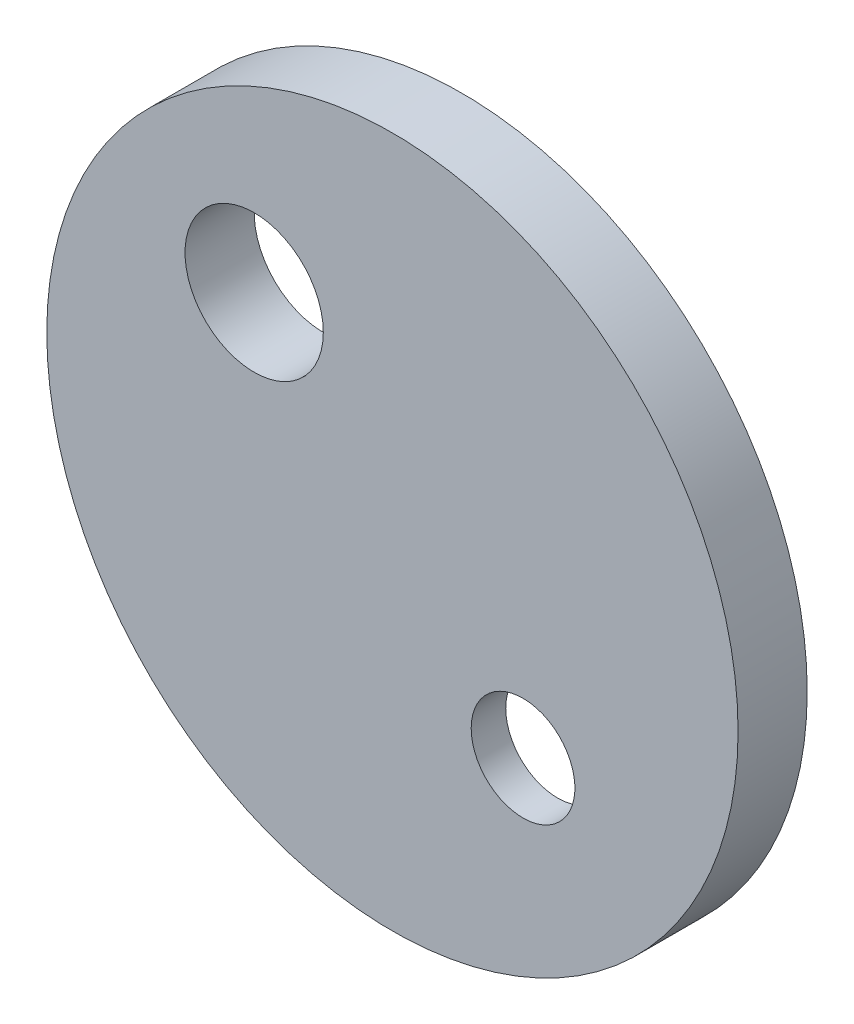
ISO-10303-21;
HEADER;
FILE_DESCRIPTION(('STEP AP214'),'2;1');
FILE_NAME('part.step','',(''),(''),'','','');
FILE_SCHEMA(('AUTOMOTIVE_DESIGN { 1 0 10303 214 1 1 1 1 }'));
ENDSEC;
DATA;
#1=APPLICATION_CONTEXT('core data for automotive mechanical design processes');
#2=APPLICATION_PROTOCOL_DEFINITION('international standard','automotive_design',2000,#1);
#3=PRODUCT_CONTEXT('',#1,'mechanical');
#4=PRODUCT('Part','Part','',(#3));
#5=PRODUCT_RELATED_PRODUCT_CATEGORY('part','',(#4));
#6=PRODUCT_DEFINITION_FORMATION('','',#4);
#7=PRODUCT_DEFINITION_CONTEXT('part definition',#1,'design');
#8=PRODUCT_DEFINITION('design','',#6,#7);
#9=PRODUCT_DEFINITION_SHAPE('','',#8);
#10=(LENGTH_UNIT() NAMED_UNIT(*) SI_UNIT(.MILLI.,.METRE.));
#11=(NAMED_UNIT(*) PLANE_ANGLE_UNIT() SI_UNIT($,.RADIAN.));
#12=(NAMED_UNIT(*) SI_UNIT($,.STERADIAN.) SOLID_ANGLE_UNIT());
#13=UNCERTAINTY_MEASURE_WITH_UNIT(LENGTH_MEASURE(1.E-05),#10,'distance_accuracy_value','');
#14=(GEOMETRIC_REPRESENTATION_CONTEXT(3) GLOBAL_UNCERTAINTY_ASSIGNED_CONTEXT((#13)) GLOBAL_UNIT_ASSIGNED_CONTEXT((#10,
#11,#12)) REPRESENTATION_CONTEXT('',''));
#15=CARTESIAN_POINT('',(0.,0.,0.));
#16=DIRECTION('',(0.,0.,1.));
#17=DIRECTION('',(1.,0.,0.));
#18=AXIS2_PLACEMENT_3D('',#15,#16,#17);
#19=CARTESIAN_POINT('',(0.,0.,0.5));
#20=DIRECTION('',(0.,0.,0.999999999999999));
#21=DIRECTION('',(1.,0.,0.));
#22=AXIS2_PLACEMENT_3D('',#19,#20,#21);
#23=PLANE('',#22);
#24=CARTESIAN_POINT('',(0.944543648263008,-0.944543648263005,0.5));
#25=DIRECTION('',(0.,0.,-0.999999999999999));
#26=DIRECTION('',(-1.,0.,0.));
#27=AXIS2_PLACEMENT_3D('',#24,#25,#26);
#28=CIRCLE('',#27,0.375);
#29=CARTESIAN_POINT('',(0.569543648263008,-0.944543648263005,0.5));
#30=VERTEX_POINT('',#29);
#31=EDGE_CURVE('E58',#30,#30,#28,.T.);
#32=ORIENTED_EDGE('',*,*,#31,.T.);
#33=EDGE_LOOP('',(#32));
#34=FACE_BOUND('',#33,.T.);
#35=CARTESIAN_POINT('',(0.,0.,0.5));
#36=DIRECTION('',(0.,0.,0.999999999999999));
#37=DIRECTION('',(1.,0.,0.));
#38=AXIS2_PLACEMENT_3D('',#35,#36,#37);
#39=CIRCLE('',#38,2.5);
#40=CARTESIAN_POINT('',(2.5,0.,0.500000000000001));
#41=VERTEX_POINT('',#40);
#42=EDGE_CURVE('E10',#41,#41,#39,.T.);
#43=ORIENTED_EDGE('',*,*,#42,.T.);
#44=EDGE_LOOP('',(#43));
#45=FACE_BOUND('',#44,.T.);
#46=CARTESIAN_POINT('',(-1.,1.00000000000002,0.499999999999999));
#47=DIRECTION('',(0.,0.,0.999999999999999));
#48=DIRECTION('',(1.,0.,0.));
#49=AXIS2_PLACEMENT_3D('',#46,#47,#48);
#50=CIRCLE('',#49,0.5);
#51=CARTESIAN_POINT('',(-0.5,1.00000000000002,0.499999999999999));
#52=VERTEX_POINT('',#51);
#53=EDGE_CURVE('E47',#52,#52,#50,.T.);
#54=ORIENTED_EDGE('',*,*,#53,.F.);
#55=EDGE_LOOP('',(#54));
#56=FACE_BOUND('',#55,.T.);
#57=ADVANCED_FACE('F36',(#34,#45,#56),#23,.T.);
#58=CARTESIAN_POINT('',(0.,0.,0.));
#59=DIRECTION('',(0.,0.,0.999999999999999));
#60=DIRECTION('',(1.,0.,0.));
#61=AXIS2_PLACEMENT_3D('',#58,#59,#60);
#62=PLANE('',#61);
#63=CARTESIAN_POINT('',(0.944543648263011,-0.944543648263007,0.));
#64=DIRECTION('',(0.,0.,-0.999999999999999));
#65=DIRECTION('',(-1.,0.,0.));
#66=AXIS2_PLACEMENT_3D('',#63,#64,#65);
#67=CIRCLE('',#66,0.75);
#68=CARTESIAN_POINT('',(0.19454364826301,-0.944543648263007,0.));
#69=VERTEX_POINT('',#68);
#70=EDGE_CURVE('E55',#69,#69,#67,.T.);
#71=ORIENTED_EDGE('',*,*,#70,.F.);
#72=EDGE_LOOP('',(#71));
#73=FACE_BOUND('',#72,.T.);
#74=CARTESIAN_POINT('',(0.,0.,0.));
#75=DIRECTION('',(0.,0.,0.999999999999999));
#76=DIRECTION('',(1.,0.,0.));
#77=AXIS2_PLACEMENT_3D('',#74,#75,#76);
#78=CIRCLE('',#77,2.5);
#79=CARTESIAN_POINT('',(2.5,0.,0.));
#80=VERTEX_POINT('',#79);
#81=EDGE_CURVE('E40',#80,#80,#78,.T.);
#82=ORIENTED_EDGE('',*,*,#81,.F.);
#83=EDGE_LOOP('',(#82));
#84=FACE_BOUND('',#83,.T.);
#85=CARTESIAN_POINT('',(-1.,1.00000000000001,0.));
#86=DIRECTION('',(0.,0.,0.999999999999999));
#87=DIRECTION('',(1.,0.,0.));
#88=AXIS2_PLACEMENT_3D('',#85,#86,#87);
#89=CIRCLE('',#88,0.5);
#90=CARTESIAN_POINT('',(-0.5,1.00000000000001,0.));
#91=VERTEX_POINT('',#90);
#92=EDGE_CURVE('E49',#91,#91,#89,.T.);
#93=ORIENTED_EDGE('',*,*,#92,.T.);
#94=EDGE_LOOP('',(#93));
#95=FACE_BOUND('',#94,.T.);
#96=ADVANCED_FACE('F82',(#73,#84,#95),#62,.F.);
#97=CARTESIAN_POINT('',(0.,0.,0.5));
#98=DIRECTION('',(0.,0.,-0.999999999999999));
#99=DIRECTION('',(-1.,0.,0.));
#100=AXIS2_PLACEMENT_3D('',#97,#98,#99);
#101=CYLINDRICAL_SURFACE('',#100,2.5);
#102=ORIENTED_EDGE('',*,*,#42,.F.);
#103=EDGE_LOOP('',(#102));
#104=FACE_BOUND('',#103,.T.);
#105=ORIENTED_EDGE('',*,*,#81,.T.);
#106=EDGE_LOOP('',(#105));
#107=FACE_BOUND('',#106,.T.);
#108=ADVANCED_FACE('F38',(#104,#107),#101,.T.);
#109=CARTESIAN_POINT('',(-1.,1.00000000000002,0.499999999999999));
#110=DIRECTION('',(0.,0.,-0.999999999999999));
#111=DIRECTION('',(-1.,0.,0.));
#112=AXIS2_PLACEMENT_3D('',#109,#110,#111);
#113=CYLINDRICAL_SURFACE('',#112,0.5);
#114=ORIENTED_EDGE('',*,*,#53,.T.);
#115=EDGE_LOOP('',(#114));
#116=FACE_BOUND('',#115,.T.);
#117=ORIENTED_EDGE('',*,*,#92,.F.);
#118=EDGE_LOOP('',(#117));
#119=FACE_BOUND('',#118,.T.);
#120=ADVANCED_FACE('F78',(#116,#119),#113,.F.);
#121=CARTESIAN_POINT('',(0.944543648263008,-0.944543648263007,0.250000000000001));
#122=DIRECTION('',(0.,0.,-0.999999999999999));
#123=DIRECTION('',(-1.,0.,0.));
#124=AXIS2_PLACEMENT_3D('',#121,#122,#123);
#125=CYLINDRICAL_SURFACE('',#124,0.75);
#126=CARTESIAN_POINT('',(0.944543648263008,-0.944543648263007,0.250000000000001));
#127=DIRECTION('',(0.,0.,-0.999999999999999));
#128=DIRECTION('',(-1.,0.,0.));
#129=AXIS2_PLACEMENT_3D('',#126,#127,#128);
#130=CIRCLE('',#129,0.75);
#131=CARTESIAN_POINT('',(0.194543648263008,-0.944543648263007,0.250000000000001));
#132=VERTEX_POINT('',#131);
#133=EDGE_CURVE('E52',#132,#132,#130,.T.);
#134=ORIENTED_EDGE('',*,*,#133,.F.);
#135=EDGE_LOOP('',(#134));
#136=FACE_BOUND('',#135,.T.);
#137=ORIENTED_EDGE('',*,*,#70,.T.);
#138=EDGE_LOOP('',(#137));
#139=FACE_BOUND('',#138,.T.);
#140=ADVANCED_FACE('F72',(#136,#139),#125,.F.);
#141=CARTESIAN_POINT('',(0.944543648263008,-0.944543648263007,0.250000000000001));
#142=DIRECTION('',(0.,0.,-0.999999999999999));
#143=DIRECTION('',(-1.,0.,0.));
#144=AXIS2_PLACEMENT_3D('',#141,#142,#143);
#145=PLANE('',#144);
#146=CARTESIAN_POINT('',(0.944543648263008,-0.944543648263007,0.25));
#147=DIRECTION('',(0.,0.,-0.999999999999999));
#148=DIRECTION('',(-1.,0.,0.));
#149=AXIS2_PLACEMENT_3D('',#146,#147,#148);
#150=CIRCLE('',#149,0.374999999999988);
#151=CARTESIAN_POINT('',(0.56954364826302,-0.944543648263007,0.25));
#152=VERTEX_POINT('',#151);
#153=EDGE_CURVE('E63',#152,#152,#150,.T.);
#154=ORIENTED_EDGE('',*,*,#153,.F.);
#155=EDGE_LOOP('',(#154));
#156=FACE_BOUND('',#155,.T.);
#157=ORIENTED_EDGE('',*,*,#133,.T.);
#158=EDGE_LOOP('',(#157));
#159=FACE_BOUND('',#158,.T.);
#160=ADVANCED_FACE('F69',(#156,#159),#145,.T.);
#161=CARTESIAN_POINT('',(0.944543648263008,-0.944543648263007,0.250000000000001));
#162=DIRECTION('',(0.,0.,-0.999999999999999));
#163=DIRECTION('',(-1.,0.,0.));
#164=AXIS2_PLACEMENT_3D('',#161,#162,#163);
#165=CYLINDRICAL_SURFACE('',#164,0.374999999999994);
#166=ORIENTED_EDGE('',*,*,#31,.F.);
#167=EDGE_LOOP('',(#166));
#168=FACE_BOUND('',#167,.T.);
#169=ORIENTED_EDGE('',*,*,#153,.T.);
#170=EDGE_LOOP('',(#169));
#171=FACE_BOUND('',#170,.T.);
#172=ADVANCED_FACE('F67',(#168,#171),#165,.F.);
#173=CLOSED_SHELL('',(#57,#96,#108,#120,#140,#160,#172));
#174=MANIFOLD_SOLID_BREP('B2',#173);
#175=ADVANCED_BREP_SHAPE_REPRESENTATION('',(#18,#174),#14);
#176=SHAPE_DEFINITION_REPRESENTATION(#9,#175);
ENDSEC;
END-ISO-10303-21;
